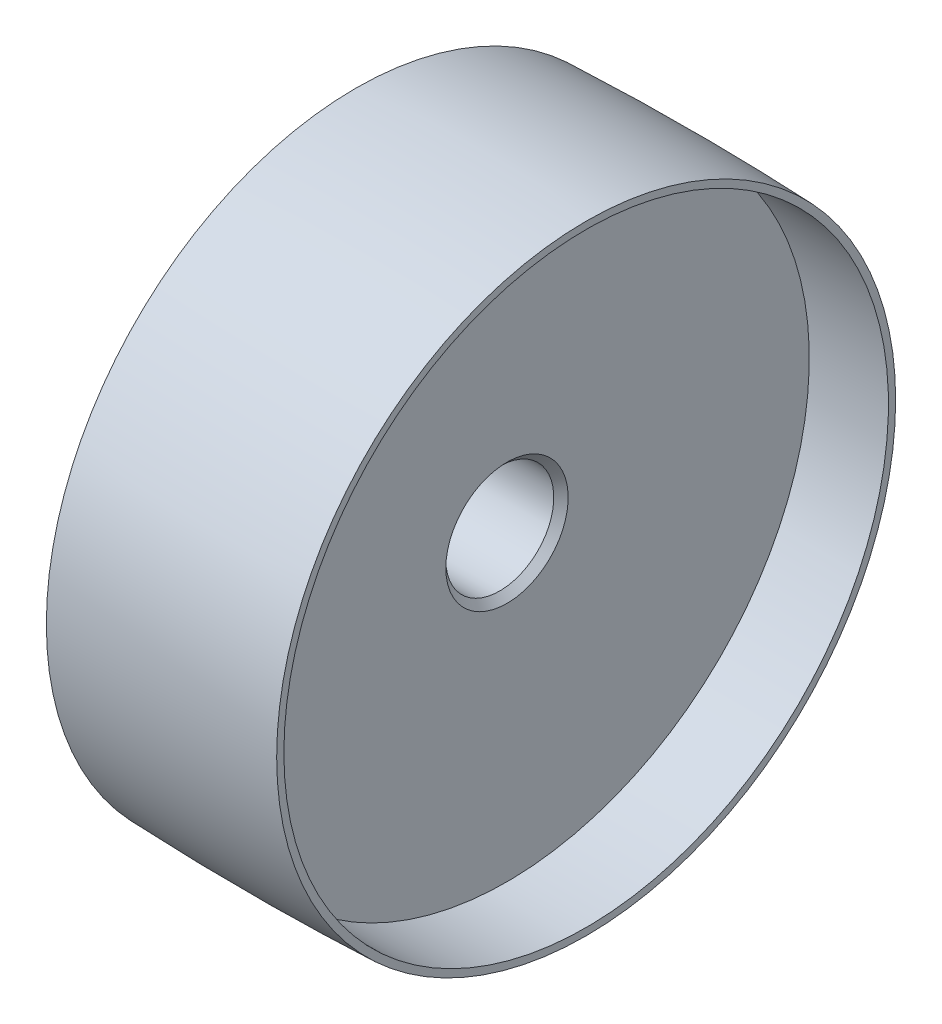
ISO-10303-21;
HEADER;
FILE_DESCRIPTION(('STEP AP214'),'2;1');
FILE_NAME('part.step','',(''),(''),'','','');
FILE_SCHEMA(('AUTOMOTIVE_DESIGN { 1 0 10303 214 1 1 1 1 }'));
ENDSEC;
DATA;
#1=APPLICATION_CONTEXT('core data for automotive mechanical design processes');
#2=APPLICATION_PROTOCOL_DEFINITION('international standard','automotive_design',2000,#1);
#3=PRODUCT_CONTEXT('',#1,'mechanical');
#4=PRODUCT('Part','Part','',(#3));
#5=PRODUCT_RELATED_PRODUCT_CATEGORY('part','',(#4));
#6=PRODUCT_DEFINITION_FORMATION('','',#4);
#7=PRODUCT_DEFINITION_CONTEXT('part definition',#1,'design');
#8=PRODUCT_DEFINITION('design','',#6,#7);
#9=PRODUCT_DEFINITION_SHAPE('','',#8);
#10=(LENGTH_UNIT() NAMED_UNIT(*) SI_UNIT(.MILLI.,.METRE.));
#11=(NAMED_UNIT(*) PLANE_ANGLE_UNIT() SI_UNIT($,.RADIAN.));
#12=(NAMED_UNIT(*) SI_UNIT($,.STERADIAN.) SOLID_ANGLE_UNIT());
#13=UNCERTAINTY_MEASURE_WITH_UNIT(LENGTH_MEASURE(1.E-05),#10,'distance_accuracy_value','');
#14=(GEOMETRIC_REPRESENTATION_CONTEXT(3) GLOBAL_UNCERTAINTY_ASSIGNED_CONTEXT((#13)) GLOBAL_UNIT_ASSIGNED_CONTEXT((#10,
#11,#12)) REPRESENTATION_CONTEXT('',''));
#15=CARTESIAN_POINT('',(0.,0.,0.));
#16=DIRECTION('',(0.,0.,1.));
#17=DIRECTION('',(1.,0.,0.));
#18=AXIS2_PLACEMENT_3D('',#15,#16,#17);
#19=CARTESIAN_POINT('',(0.,0.,0.));
#20=DIRECTION('',(-1.,0.,0.));
#21=DIRECTION('',(0.,0.,1.));
#22=AXIS2_PLACEMENT_3D('',#19,#20,#21);
#23=CYLINDRICAL_SURFACE('',#22,7.5);
#24=CARTESIAN_POINT('',(0.999999999999993,0.,0.));
#25=DIRECTION('',(1.,0.,0.));
#26=DIRECTION('',(0.,0.,-1.));
#27=AXIS2_PLACEMENT_3D('',#24,#25,#26);
#28=CIRCLE('',#27,7.5);
#29=CARTESIAN_POINT('',(0.999999999999993,0.,-7.5));
#30=VERTEX_POINT('',#29);
#31=EDGE_CURVE('E70',#30,#30,#28,.F.);
#32=ORIENTED_EDGE('',*,*,#31,.T.);
#33=EDGE_LOOP('',(#32));
#34=FACE_BOUND('',#33,.T.);
#35=CARTESIAN_POINT('',(20.,0.,0.));
#36=DIRECTION('',(-1.,0.,0.));
#37=DIRECTION('',(0.,0.,1.));
#38=AXIS2_PLACEMENT_3D('',#35,#36,#37);
#39=CIRCLE('',#38,7.5);
#40=CARTESIAN_POINT('',(20.,0.,7.5));
#41=VERTEX_POINT('',#40);
#42=EDGE_CURVE('E74',#41,#41,#39,.F.);
#43=ORIENTED_EDGE('',*,*,#42,.T.);
#44=EDGE_LOOP('',(#43));
#45=FACE_BOUND('',#44,.T.);
#46=ADVANCED_FACE('F45',(#34,#45),#23,.F.);
#47=CARTESIAN_POINT('',(0.,7.5,0.));
#48=DIRECTION('',(1.,0.,0.));
#49=DIRECTION('',(0.,0.,-1.));
#50=AXIS2_PLACEMENT_3D('',#47,#48,#49);
#51=PLANE('',#50);
#52=CARTESIAN_POINT('',(0.,0.,0.));
#53=DIRECTION('',(1.,0.,0.));
#54=DIRECTION('',(0.,0.,-1.));
#55=AXIS2_PLACEMENT_3D('',#52,#53,#54);
#56=CIRCLE('',#55,8.49999999999998);
#57=CARTESIAN_POINT('',(0.,0.,-8.49999999999998));
#58=VERTEX_POINT('',#57);
#59=EDGE_CURVE('E59',#58,#58,#56,.T.);
#60=ORIENTED_EDGE('',*,*,#59,.T.);
#61=EDGE_LOOP('',(#60));
#62=FACE_BOUND('',#61,.T.);
#63=CARTESIAN_POINT('',(0.,0.,0.));
#64=DIRECTION('',(1.,0.,0.));
#65=DIRECTION('',(0.,0.,-1.));
#66=AXIS2_PLACEMENT_3D('',#63,#64,#65);
#67=CIRCLE('',#66,14.);
#68=CARTESIAN_POINT('',(0.,0.,-14.));
#69=VERTEX_POINT('',#68);
#70=EDGE_CURVE('E64',#69,#69,#67,.F.);
#71=ORIENTED_EDGE('',*,*,#70,.T.);
#72=EDGE_LOOP('',(#71));
#73=FACE_BOUND('',#72,.T.);
#74=ADVANCED_FACE('F125',(#62,#73),#51,.F.);
#75=CARTESIAN_POINT('',(0.,0.,0.));
#76=DIRECTION('',(-1.,0.,0.));
#77=DIRECTION('',(0.,0.,1.));
#78=AXIS2_PLACEMENT_3D('',#75,#76,#77);
#79=CYLINDRICAL_SURFACE('',#78,15.);
#80=CARTESIAN_POINT('',(1.00000000000003,0.,0.));
#81=DIRECTION('',(1.,0.,0.));
#82=DIRECTION('',(0.,0.,-1.));
#83=AXIS2_PLACEMENT_3D('',#80,#81,#82);
#84=CIRCLE('',#83,15.);
#85=CARTESIAN_POINT('',(1.00000000000003,0.,-15.));
#86=VERTEX_POINT('',#85);
#87=EDGE_CURVE('E10',#86,#86,#84,.T.);
#88=ORIENTED_EDGE('',*,*,#87,.T.);
#89=EDGE_LOOP('',(#88));
#90=FACE_BOUND('',#89,.T.);
#91=CARTESIAN_POINT('',(11.,0.,0.));
#92=DIRECTION('',(-1.,0.,0.));
#93=DIRECTION('',(0.,0.,1.));
#94=AXIS2_PLACEMENT_3D('',#91,#92,#93);
#95=CIRCLE('',#94,15.);
#96=CARTESIAN_POINT('',(11.,0.,15.));
#97=VERTEX_POINT('',#96);
#98=EDGE_CURVE('E78',#97,#97,#95,.T.);
#99=ORIENTED_EDGE('',*,*,#98,.T.);
#100=EDGE_LOOP('',(#99));
#101=FACE_BOUND('',#100,.T.);
#102=ADVANCED_FACE('F131',(#90,#101),#79,.T.);
#103=CARTESIAN_POINT('',(11.,15.,0.));
#104=DIRECTION('',(1.,0.,0.));
#105=DIRECTION('',(0.,0.,-1.));
#106=AXIS2_PLACEMENT_3D('',#103,#104,#105);
#107=PLANE('',#106);
#108=ORIENTED_EDGE('',*,*,#98,.F.);
#109=EDGE_LOOP('',(#108));
#110=FACE_BOUND('',#109,.T.);
#111=CARTESIAN_POINT('',(11.,0.,0.));
#112=DIRECTION('',(-1.,0.,0.));
#113=DIRECTION('',(0.,0.,1.));
#114=AXIS2_PLACEMENT_3D('',#111,#112,#113);
#115=CIRCLE('',#114,42.);
#116=CARTESIAN_POINT('',(11.,0.,42.));
#117=VERTEX_POINT('',#116);
#118=EDGE_CURVE('E82',#117,#117,#115,.T.);
#119=ORIENTED_EDGE('',*,*,#118,.T.);
#120=EDGE_LOOP('',(#119));
#121=FACE_BOUND('',#120,.T.);
#122=ADVANCED_FACE('F215',(#110,#121),#107,.F.);
#123=CARTESIAN_POINT('',(0.,0.,0.));
#124=DIRECTION('',(-1.,0.,0.));
#125=DIRECTION('',(0.,0.,1.));
#126=AXIS2_PLACEMENT_3D('',#123,#124,#125);
#127=CYLINDRICAL_SURFACE('',#126,42.);
#128=ORIENTED_EDGE('',*,*,#118,.F.);
#129=EDGE_LOOP('',(#128));
#130=FACE_BOUND('',#129,.T.);
#131=CARTESIAN_POINT('',(0.,0.,0.));
#132=DIRECTION('',(-1.,0.,0.));
#133=DIRECTION('',(0.,0.,1.));
#134=AXIS2_PLACEMENT_3D('',#131,#132,#133);
#135=CIRCLE('',#134,42.);
#136=CARTESIAN_POINT('',(0.,0.,42.));
#137=VERTEX_POINT('',#136);
#138=EDGE_CURVE('E86',#137,#137,#135,.T.);
#139=ORIENTED_EDGE('',*,*,#138,.T.);
#140=EDGE_LOOP('',(#139));
#141=FACE_BOUND('',#140,.T.);
#142=ADVANCED_FACE('F205',(#130,#141),#127,.F.);
#143=CARTESIAN_POINT('',(0.,42.,0.));
#144=DIRECTION('',(1.,0.,0.));
#145=DIRECTION('',(0.,0.,-1.));
#146=AXIS2_PLACEMENT_3D('',#143,#144,#145);
#147=PLANE('',#146);
#148=ORIENTED_EDGE('',*,*,#138,.F.);
#149=EDGE_LOOP('',(#148));
#150=FACE_BOUND('',#149,.T.);
#151=CARTESIAN_POINT('',(0.,0.,0.));
#152=DIRECTION('',(-1.,0.,0.));
#153=DIRECTION('',(0.,0.,1.));
#154=AXIS2_PLACEMENT_3D('',#151,#152,#153);
#155=CIRCLE('',#154,43.);
#156=CARTESIAN_POINT('',(0.,0.,43.));
#157=VERTEX_POINT('',#156);
#158=EDGE_CURVE('E90',#157,#157,#155,.T.);
#159=ORIENTED_EDGE('',*,*,#158,.T.);
#160=EDGE_LOOP('',(#159));
#161=FACE_BOUND('',#160,.T.);
#162=ADVANCED_FACE('F195',(#150,#161),#147,.F.);
#163=CARTESIAN_POINT('',(16.,0.,0.));
#164=DIRECTION('',(-1.,0.,0.));
#165=DIRECTION('',(0.,0.,1.));
#166=AXIS2_PLACEMENT_3D('',#163,#164,#165);
#167=DEGENERATE_TOROIDAL_SURFACE('',#166,383.516666666666,426.816666666666,.F.);
#168=ORIENTED_EDGE('',*,*,#158,.F.);
#169=EDGE_LOOP('',(#168));
#170=FACE_BOUND('',#169,.T.);
#171=CARTESIAN_POINT('',(32.,0.,0.));
#172=DIRECTION('',(-1.,0.,0.));
#173=DIRECTION('',(0.,0.,1.));
#174=AXIS2_PLACEMENT_3D('',#171,#172,#173);
#175=CIRCLE('',#174,43.);
#176=CARTESIAN_POINT('',(32.,0.,43.));
#177=VERTEX_POINT('',#176);
#178=EDGE_CURVE('E94',#177,#177,#175,.T.);
#179=ORIENTED_EDGE('',*,*,#178,.T.);
#180=EDGE_LOOP('',(#179));
#181=FACE_BOUND('',#180,.T.);
#182=ADVANCED_FACE('F185',(#170,#181),#167,.F.);
#183=CARTESIAN_POINT('',(32.,42.,0.));
#184=DIRECTION('',(-1.,0.,0.));
#185=DIRECTION('',(0.,0.,1.));
#186=AXIS2_PLACEMENT_3D('',#183,#184,#185);
#187=PLANE('',#186);
#188=ORIENTED_EDGE('',*,*,#178,.F.);
#189=EDGE_LOOP('',(#188));
#190=FACE_BOUND('',#189,.T.);
#191=CARTESIAN_POINT('',(32.,0.,0.));
#192=DIRECTION('',(-1.,0.,0.));
#193=DIRECTION('',(0.,0.,1.));
#194=AXIS2_PLACEMENT_3D('',#191,#192,#193);
#195=CIRCLE('',#194,42.);
#196=CARTESIAN_POINT('',(32.,0.,42.));
#197=VERTEX_POINT('',#196);
#198=EDGE_CURVE('E98',#197,#197,#195,.T.);
#199=ORIENTED_EDGE('',*,*,#198,.T.);
#200=EDGE_LOOP('',(#199));
#201=FACE_BOUND('',#200,.T.);
#202=ADVANCED_FACE('F121',(#190,#201),#187,.F.);
#203=CARTESIAN_POINT('',(0.,0.,0.));
#204=DIRECTION('',(-1.,0.,0.));
#205=DIRECTION('',(0.,0.,1.));
#206=AXIS2_PLACEMENT_3D('',#203,#204,#205);
#207=CYLINDRICAL_SURFACE('',#206,42.);
#208=ORIENTED_EDGE('',*,*,#198,.F.);
#209=EDGE_LOOP('',(#208));
#210=FACE_BOUND('',#209,.T.);
#211=CARTESIAN_POINT('',(21.,0.,0.));
#212=DIRECTION('',(-1.,0.,0.));
#213=DIRECTION('',(0.,0.,1.));
#214=AXIS2_PLACEMENT_3D('',#211,#212,#213);
#215=CIRCLE('',#214,42.);
#216=CARTESIAN_POINT('',(21.,0.,42.));
#217=VERTEX_POINT('',#216);
#218=EDGE_CURVE('E102',#217,#217,#215,.T.);
#219=ORIENTED_EDGE('',*,*,#218,.T.);
#220=EDGE_LOOP('',(#219));
#221=FACE_BOUND('',#220,.T.);
#222=ADVANCED_FACE('F107',(#210,#221),#207,.F.);
#223=CARTESIAN_POINT('',(21.,7.5,0.));
#224=DIRECTION('',(-1.,0.,0.));
#225=DIRECTION('',(0.,0.,1.));
#226=AXIS2_PLACEMENT_3D('',#223,#224,#225);
#227=PLANE('',#226);
#228=CARTESIAN_POINT('',(21.,0.,0.));
#229=DIRECTION('',(-1.,0.,0.));
#230=DIRECTION('',(0.,0.,1.));
#231=AXIS2_PLACEMENT_3D('',#228,#229,#230);
#232=CIRCLE('',#231,8.50000000000001);
#233=CARTESIAN_POINT('',(21.,0.,8.50000000000001));
#234=VERTEX_POINT('',#233);
#235=EDGE_CURVE('E54',#234,#234,#232,.T.);
#236=ORIENTED_EDGE('',*,*,#235,.T.);
#237=EDGE_LOOP('',(#236));
#238=FACE_BOUND('',#237,.T.);
#239=ORIENTED_EDGE('',*,*,#218,.F.);
#240=EDGE_LOOP('',(#239));
#241=FACE_BOUND('',#240,.T.);
#242=ADVANCED_FACE('F109',(#238,#241),#227,.F.);
#243=CARTESIAN_POINT('',(0.999999999999993,0.,0.));
#244=DIRECTION('',(-1.,0.,0.));
#245=DIRECTION('',(0.,0.,1.));
#246=AXIS2_PLACEMENT_3D('',#243,#244,#245);
#247=CONICAL_SURFACE('',#246,7.5,0.785398163397442);
#248=ORIENTED_EDGE('',*,*,#59,.F.);
#249=EDGE_LOOP('',(#248));
#250=FACE_BOUND('',#249,.T.);
#251=ORIENTED_EDGE('',*,*,#31,.F.);
#252=EDGE_LOOP('',(#251));
#253=FACE_BOUND('',#252,.T.);
#254=ADVANCED_FACE('F111',(#250,#253),#247,.F.);
#255=CARTESIAN_POINT('',(21.,0.,0.));
#256=DIRECTION('',(1.,0.,0.));
#257=DIRECTION('',(0.,0.,-1.));
#258=AXIS2_PLACEMENT_3D('',#255,#256,#257);
#259=CONICAL_SURFACE('',#258,8.50000000000001,0.785398163397448);
#260=ORIENTED_EDGE('',*,*,#42,.F.);
#261=EDGE_LOOP('',(#260));
#262=FACE_BOUND('',#261,.T.);
#263=ORIENTED_EDGE('',*,*,#235,.F.);
#264=EDGE_LOOP('',(#263));
#265=FACE_BOUND('',#264,.T.);
#266=ADVANCED_FACE('F117',(#262,#265),#259,.F.);
#267=CARTESIAN_POINT('',(0.,0.,0.));
#268=DIRECTION('',(1.,0.,0.));
#269=DIRECTION('',(0.,0.,-1.));
#270=AXIS2_PLACEMENT_3D('',#267,#268,#269);
#271=CONICAL_SURFACE('',#270,14.,0.785398163397444);
#272=ORIENTED_EDGE('',*,*,#87,.F.);
#273=EDGE_LOOP('',(#272));
#274=FACE_BOUND('',#273,.T.);
#275=ORIENTED_EDGE('',*,*,#70,.F.);
#276=EDGE_LOOP('',(#275));
#277=FACE_BOUND('',#276,.T.);
#278=ADVANCED_FACE('F48',(#274,#277),#271,.T.);
#279=CLOSED_SHELL('',(#46,#74,#102,#122,#142,#162,#182,#202,#222,#242,#254,#266,#278));
#280=MANIFOLD_SOLID_BREP('B2',#279);
#281=ADVANCED_BREP_SHAPE_REPRESENTATION('',(#18,#280),#14);
#282=SHAPE_DEFINITION_REPRESENTATION(#9,#281);
ENDSEC;
END-ISO-10303-21;
